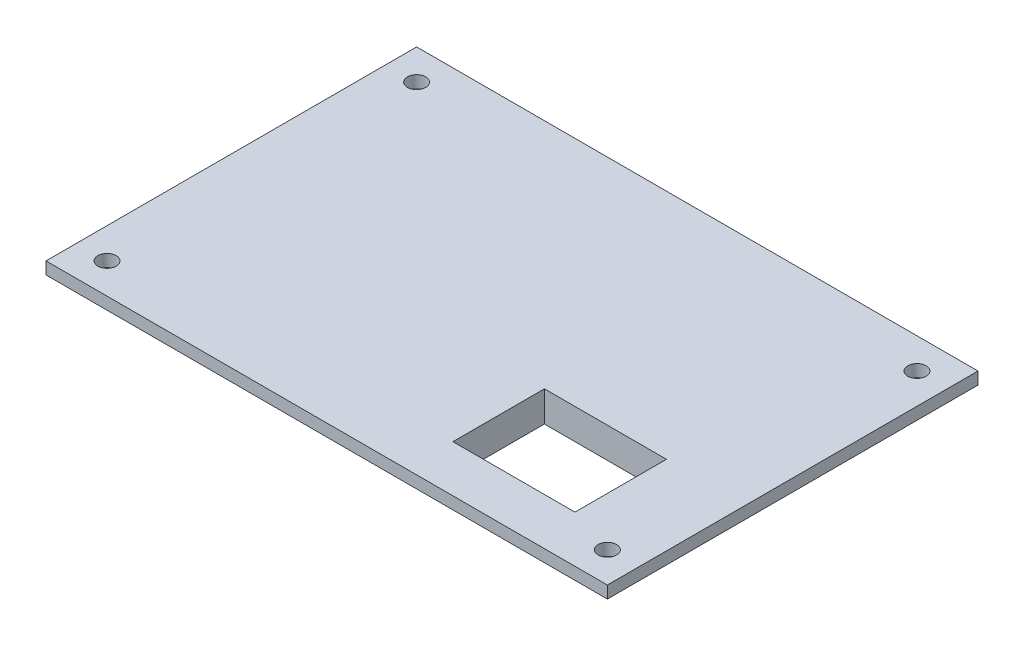
ISO-10303-21;
HEADER;
FILE_DESCRIPTION(('STEP AP214'),'2;1');
FILE_NAME('part.step','',(''),(''),'','','');
FILE_SCHEMA(('AUTOMOTIVE_DESIGN { 1 0 10303 214 1 1 1 1 }'));
ENDSEC;
DATA;
#1=APPLICATION_CONTEXT('core data for automotive mechanical design processes');
#2=APPLICATION_PROTOCOL_DEFINITION('international standard','automotive_design',2000,#1);
#3=PRODUCT_CONTEXT('',#1,'mechanical');
#4=PRODUCT('Part','Part','',(#3));
#5=PRODUCT_RELATED_PRODUCT_CATEGORY('part','',(#4));
#6=PRODUCT_DEFINITION_FORMATION('','',#4);
#7=PRODUCT_DEFINITION_CONTEXT('part definition',#1,'design');
#8=PRODUCT_DEFINITION('design','',#6,#7);
#9=PRODUCT_DEFINITION_SHAPE('','',#8);
#10=(LENGTH_UNIT() NAMED_UNIT(*) SI_UNIT(.MILLI.,.METRE.));
#11=(NAMED_UNIT(*) PLANE_ANGLE_UNIT() SI_UNIT($,.RADIAN.));
#12=(NAMED_UNIT(*) SI_UNIT($,.STERADIAN.) SOLID_ANGLE_UNIT());
#13=UNCERTAINTY_MEASURE_WITH_UNIT(LENGTH_MEASURE(1.E-05),#10,'distance_accuracy_value','');
#14=(GEOMETRIC_REPRESENTATION_CONTEXT(3) GLOBAL_UNCERTAINTY_ASSIGNED_CONTEXT((#13)) GLOBAL_UNIT_ASSIGNED_CONTEXT((#10,
#11,#12)) REPRESENTATION_CONTEXT('',''));
#15=CARTESIAN_POINT('',(0.,0.,0.));
#16=DIRECTION('',(0.,0.,1.));
#17=DIRECTION('',(1.,0.,0.));
#18=AXIS2_PLACEMENT_3D('',#15,#16,#17);
#19=CARTESIAN_POINT('',(0.,0.,0.));
#20=DIRECTION('',(0.,1.,0.));
#21=DIRECTION('',(0.,0.,1.));
#22=AXIS2_PLACEMENT_3D('',#19,#20,#21);
#23=PLANE('',#22);
#24=DIRECTION('',(-1.,0.,0.));
#25=VECTOR('',#24,1.);
#26=CARTESIAN_POINT('',(46.,0.,-30.37));
#27=LINE('',#26,#25);
#28=CARTESIAN_POINT('',(46.,0.,-30.37));
#29=VERTEX_POINT('',#28);
#30=CARTESIAN_POINT('',(-46.0000000000003,0.,-30.37));
#31=VERTEX_POINT('',#30);
#32=EDGE_CURVE('E218',#29,#31,#27,.T.);
#33=ORIENTED_EDGE('',*,*,#32,.F.);
#34=DIRECTION('',(0.,0.,-1.));
#35=VECTOR('',#34,1.);
#36=CARTESIAN_POINT('',(46.,0.,30.37));
#37=LINE('',#36,#35);
#38=CARTESIAN_POINT('',(46.,0.,30.37));
#39=VERTEX_POINT('',#38);
#40=EDGE_CURVE('E211',#39,#29,#37,.T.);
#41=ORIENTED_EDGE('',*,*,#40,.F.);
#42=DIRECTION('',(1.,0.,0.));
#43=VECTOR('',#42,1.);
#44=CARTESIAN_POINT('',(-46.0000000000003,0.,30.37));
#45=LINE('',#44,#43);
#46=CARTESIAN_POINT('',(-46.0000000000003,0.,30.37));
#47=VERTEX_POINT('',#46);
#48=EDGE_CURVE('E223',#47,#39,#45,.T.);
#49=ORIENTED_EDGE('',*,*,#48,.F.);
#50=DIRECTION('',(0.,0.,1.));
#51=VECTOR('',#50,1.);
#52=CARTESIAN_POINT('',(-46.0000000000003,0.,-30.37));
#53=LINE('',#52,#51);
#54=EDGE_CURVE('E221',#31,#47,#53,.T.);
#55=ORIENTED_EDGE('',*,*,#54,.F.);
#56=EDGE_LOOP('',(#33,#41,#49,#55));
#57=FACE_BOUND('',#56,.T.);
#58=CARTESIAN_POINT('',(-40.9999999999968,0.,-25.3700000000047));
#59=DIRECTION('',(0.,1.,0.));
#60=DIRECTION('',(0.,0.,1.));
#61=AXIS2_PLACEMENT_3D('',#58,#59,#60);
#62=CIRCLE('',#61,1.5);
#63=CARTESIAN_POINT('',(-40.9999999999968,0.,-23.8700000000047));
#64=VERTEX_POINT('',#63);
#65=EDGE_CURVE('E206',#64,#64,#62,.T.);
#66=ORIENTED_EDGE('',*,*,#65,.T.);
#67=EDGE_LOOP('',(#66));
#68=FACE_BOUND('',#67,.T.);
#69=CARTESIAN_POINT('',(41.0000000000002,0.,-25.3700000000047));
#70=DIRECTION('',(0.,1.,0.));
#71=DIRECTION('',(0.,0.,1.));
#72=AXIS2_PLACEMENT_3D('',#69,#70,#71);
#73=CIRCLE('',#72,1.5);
#74=CARTESIAN_POINT('',(41.0000000000002,0.,-23.8700000000047));
#75=VERTEX_POINT('',#74);
#76=EDGE_CURVE('E235',#75,#75,#73,.T.);
#77=ORIENTED_EDGE('',*,*,#76,.T.);
#78=EDGE_LOOP('',(#77));
#79=FACE_BOUND('',#78,.T.);
#80=CARTESIAN_POINT('',(41.0000000000002,0.,25.3700000000047));
#81=DIRECTION('',(0.,1.,0.));
#82=DIRECTION('',(0.,0.,1.));
#83=AXIS2_PLACEMENT_3D('',#80,#81,#82);
#84=CIRCLE('',#83,1.5);
#85=CARTESIAN_POINT('',(41.0000000000002,0.,26.8700000000047));
#86=VERTEX_POINT('',#85);
#87=EDGE_CURVE('E237',#86,#86,#84,.T.);
#88=ORIENTED_EDGE('',*,*,#87,.T.);
#89=EDGE_LOOP('',(#88));
#90=FACE_BOUND('',#89,.T.);
#91=CARTESIAN_POINT('',(-40.9999999999968,0.,25.3700000000047));
#92=DIRECTION('',(0.,1.,0.));
#93=DIRECTION('',(0.,0.,1.));
#94=AXIS2_PLACEMENT_3D('',#91,#92,#93);
#95=CIRCLE('',#94,1.5);
#96=CARTESIAN_POINT('',(-40.9999999999968,0.,26.8700000000047));
#97=VERTEX_POINT('',#96);
#98=EDGE_CURVE('E39',#97,#97,#95,.T.);
#99=ORIENTED_EDGE('',*,*,#98,.T.);
#100=EDGE_LOOP('',(#99));
#101=FACE_BOUND('',#100,.T.);
#102=DIRECTION('',(-1.,0.,0.));
#103=VECTOR('',#102,1.);
#104=CARTESIAN_POINT('',(35.0000000000095,0.,24.6849999999978));
#105=LINE('',#104,#103);
#106=CARTESIAN_POINT('',(35.0000000000095,0.,24.6849999999978));
#107=VERTEX_POINT('',#106);
#108=CARTESIAN_POINT('',(11.0000000000044,0.,24.6849999999978));
#109=VERTEX_POINT('',#108);
#110=EDGE_CURVE('E153',#107,#109,#105,.T.);
#111=ORIENTED_EDGE('',*,*,#110,.F.);
#112=DIRECTION('',(0.,0.,1.));
#113=VECTOR('',#112,1.);
#114=CARTESIAN_POINT('',(35.0000000000095,0.,5.68500000000463));
#115=LINE('',#114,#113);
#116=CARTESIAN_POINT('',(35.0000000000095,0.,5.68500000000463));
#117=VERTEX_POINT('',#116);
#118=EDGE_CURVE('E158',#117,#107,#115,.T.);
#119=ORIENTED_EDGE('',*,*,#118,.F.);
#120=DIRECTION('',(1.,0.,0.));
#121=VECTOR('',#120,1.);
#122=CARTESIAN_POINT('',(11.0000000000044,0.,5.68500000000463));
#123=LINE('',#122,#121);
#124=CARTESIAN_POINT('',(11.0000000000044,0.,5.68500000000463));
#125=VERTEX_POINT('',#124);
#126=EDGE_CURVE('E57',#125,#117,#123,.T.);
#127=ORIENTED_EDGE('',*,*,#126,.F.);
#128=DIRECTION('',(0.,0.,-1.));
#129=VECTOR('',#128,1.);
#130=CARTESIAN_POINT('',(11.0000000000044,0.,24.6849999999978));
#131=LINE('',#130,#129);
#132=EDGE_CURVE('E52',#109,#125,#131,.T.);
#133=ORIENTED_EDGE('',*,*,#132,.F.);
#134=EDGE_LOOP('',(#111,#119,#127,#133));
#135=FACE_BOUND('',#134,.T.);
#136=ADVANCED_FACE('F35',(#57,#68,#79,#90,#101,#135),#23,.F.);
#137=CARTESIAN_POINT('',(46.,2.,-30.37));
#138=DIRECTION('',(0.,0.,1.));
#139=DIRECTION('',(1.,0.,0.));
#140=AXIS2_PLACEMENT_3D('',#137,#138,#139);
#141=PLANE('',#140);
#142=ORIENTED_EDGE('',*,*,#32,.T.);
#143=DIRECTION('',(0.,-1.,0.));
#144=VECTOR('',#143,1.);
#145=CARTESIAN_POINT('',(-46.0000000000003,2.,-30.37));
#146=LINE('',#145,#144);
#147=CARTESIAN_POINT('',(-46.0000000000003,2.,-30.37));
#148=VERTEX_POINT('',#147);
#149=EDGE_CURVE('E11',#148,#31,#146,.T.);
#150=ORIENTED_EDGE('',*,*,#149,.F.);
#151=DIRECTION('',(-1.,0.,0.));
#152=VECTOR('',#151,1.);
#153=CARTESIAN_POINT('',(46.,2.,-30.37));
#154=LINE('',#153,#152);
#155=CARTESIAN_POINT('',(46.,2.,-30.37));
#156=VERTEX_POINT('',#155);
#157=EDGE_CURVE('E207',#156,#148,#154,.T.);
#158=ORIENTED_EDGE('',*,*,#157,.F.);
#159=DIRECTION('',(0.,-1.,0.));
#160=VECTOR('',#159,1.);
#161=CARTESIAN_POINT('',(46.,2.,-30.37));
#162=LINE('',#161,#160);
#163=EDGE_CURVE('E217',#156,#29,#162,.T.);
#164=ORIENTED_EDGE('',*,*,#163,.T.);
#165=EDGE_LOOP('',(#142,#150,#158,#164));
#166=FACE_BOUND('',#165,.T.);
#167=ADVANCED_FACE('F37',(#166),#141,.F.);
#168=CARTESIAN_POINT('',(-46.0000000000003,2.,-30.37));
#169=DIRECTION('',(1.,0.,0.));
#170=DIRECTION('',(0.,0.,-1.));
#171=AXIS2_PLACEMENT_3D('',#168,#169,#170);
#172=PLANE('',#171);
#173=ORIENTED_EDGE('',*,*,#54,.T.);
#174=DIRECTION('',(0.,-1.,0.));
#175=VECTOR('',#174,1.);
#176=CARTESIAN_POINT('',(-46.0000000000003,2.,30.37));
#177=LINE('',#176,#175);
#178=CARTESIAN_POINT('',(-46.0000000000003,2.,30.37));
#179=VERTEX_POINT('',#178);
#180=EDGE_CURVE('E44',#179,#47,#177,.T.);
#181=ORIENTED_EDGE('',*,*,#180,.F.);
#182=DIRECTION('',(0.,0.,1.));
#183=VECTOR('',#182,1.);
#184=CARTESIAN_POINT('',(-46.0000000000003,2.,-30.37));
#185=LINE('',#184,#183);
#186=EDGE_CURVE('E210',#148,#179,#185,.T.);
#187=ORIENTED_EDGE('',*,*,#186,.F.);
#188=ORIENTED_EDGE('',*,*,#149,.T.);
#189=EDGE_LOOP('',(#173,#181,#187,#188));
#190=FACE_BOUND('',#189,.T.);
#191=ADVANCED_FACE('F270',(#190),#172,.F.);
#192=CARTESIAN_POINT('',(-46.0000000000003,2.,30.37));
#193=DIRECTION('',(0.,0.,-1.));
#194=DIRECTION('',(-1.,0.,0.));
#195=AXIS2_PLACEMENT_3D('',#192,#193,#194);
#196=PLANE('',#195);
#197=ORIENTED_EDGE('',*,*,#48,.T.);
#198=DIRECTION('',(0.,-1.,0.));
#199=VECTOR('',#198,1.);
#200=CARTESIAN_POINT('',(46.,2.,30.37));
#201=LINE('',#200,#199);
#202=CARTESIAN_POINT('',(46.,2.,30.37));
#203=VERTEX_POINT('',#202);
#204=EDGE_CURVE('E228',#203,#39,#201,.T.);
#205=ORIENTED_EDGE('',*,*,#204,.F.);
#206=DIRECTION('',(1.,0.,0.));
#207=VECTOR('',#206,1.);
#208=CARTESIAN_POINT('',(-46.0000000000003,2.,30.37));
#209=LINE('',#208,#207);
#210=EDGE_CURVE('E213',#179,#203,#209,.T.);
#211=ORIENTED_EDGE('',*,*,#210,.F.);
#212=ORIENTED_EDGE('',*,*,#180,.T.);
#213=EDGE_LOOP('',(#197,#205,#211,#212));
#214=FACE_BOUND('',#213,.T.);
#215=ADVANCED_FACE('F280',(#214),#196,.F.);
#216=CARTESIAN_POINT('',(46.,2.,30.37));
#217=DIRECTION('',(-1.,0.,0.));
#218=DIRECTION('',(0.,0.,1.));
#219=AXIS2_PLACEMENT_3D('',#216,#217,#218);
#220=PLANE('',#219);
#221=ORIENTED_EDGE('',*,*,#40,.T.);
#222=ORIENTED_EDGE('',*,*,#163,.F.);
#223=DIRECTION('',(0.,0.,-1.));
#224=VECTOR('',#223,1.);
#225=CARTESIAN_POINT('',(46.,2.,30.37));
#226=LINE('',#225,#224);
#227=EDGE_CURVE('E215',#203,#156,#226,.T.);
#228=ORIENTED_EDGE('',*,*,#227,.F.);
#229=ORIENTED_EDGE('',*,*,#204,.T.);
#230=EDGE_LOOP('',(#221,#222,#228,#229));
#231=FACE_BOUND('',#230,.T.);
#232=ADVANCED_FACE('F277',(#231),#220,.F.);
#233=CARTESIAN_POINT('',(0.,2.,0.));
#234=DIRECTION('',(0.,1.,0.));
#235=DIRECTION('',(0.,0.,1.));
#236=AXIS2_PLACEMENT_3D('',#233,#234,#235);
#237=PLANE('',#236);
#238=DIRECTION('',(0.,0.,-1.));
#239=VECTOR('',#238,1.);
#240=CARTESIAN_POINT('',(33.0000000000095,2.,0.));
#241=LINE('',#240,#239);
#242=CARTESIAN_POINT('',(33.0000000000095,2.,22.6849999999978));
#243=VERTEX_POINT('',#242);
#244=CARTESIAN_POINT('',(33.0000000000095,2.,7.68500000000463));
#245=VERTEX_POINT('',#244);
#246=EDGE_CURVE('E181',#243,#245,#241,.T.);
#247=ORIENTED_EDGE('',*,*,#246,.F.);
#248=DIRECTION('',(1.,0.,0.));
#249=VECTOR('',#248,1.);
#250=CARTESIAN_POINT('',(0.,2.,22.6849999999978));
#251=LINE('',#250,#249);
#252=CARTESIAN_POINT('',(13.0000000000044,2.,22.6849999999978));
#253=VERTEX_POINT('',#252);
#254=EDGE_CURVE('E187',#253,#243,#251,.T.);
#255=ORIENTED_EDGE('',*,*,#254,.F.);
#256=DIRECTION('',(0.,0.,1.));
#257=VECTOR('',#256,1.);
#258=CARTESIAN_POINT('',(13.0000000000044,2.,0.));
#259=LINE('',#258,#257);
#260=CARTESIAN_POINT('',(13.0000000000044,2.,7.68500000000463));
#261=VERTEX_POINT('',#260);
#262=EDGE_CURVE('E131',#261,#253,#259,.T.);
#263=ORIENTED_EDGE('',*,*,#262,.F.);
#264=DIRECTION('',(-1.,0.,0.));
#265=VECTOR('',#264,1.);
#266=CARTESIAN_POINT('',(0.,2.,7.68500000000463));
#267=LINE('',#266,#265);
#268=EDGE_CURVE('E183',#245,#261,#267,.T.);
#269=ORIENTED_EDGE('',*,*,#268,.F.);
#270=EDGE_LOOP('',(#247,#255,#263,#269));
#271=FACE_BOUND('',#270,.T.);
#272=CARTESIAN_POINT('',(-40.9999999999968,2.,25.3700000000047));
#273=DIRECTION('',(0.,1.,0.));
#274=DIRECTION('',(0.,0.,1.));
#275=AXIS2_PLACEMENT_3D('',#272,#273,#274);
#276=CIRCLE('',#275,1.5);
#277=CARTESIAN_POINT('',(-40.9999999999968,2.,26.8700000000047));
#278=VERTEX_POINT('',#277);
#279=EDGE_CURVE('E190',#278,#278,#276,.T.);
#280=ORIENTED_EDGE('',*,*,#279,.F.);
#281=EDGE_LOOP('',(#280));
#282=FACE_BOUND('',#281,.T.);
#283=CARTESIAN_POINT('',(41.0000000000002,2.,25.3700000000047));
#284=DIRECTION('',(0.,1.,0.));
#285=DIRECTION('',(0.,0.,1.));
#286=AXIS2_PLACEMENT_3D('',#283,#284,#285);
#287=CIRCLE('',#286,1.5);
#288=CARTESIAN_POINT('',(41.0000000000002,2.,26.8700000000047));
#289=VERTEX_POINT('',#288);
#290=EDGE_CURVE('E199',#289,#289,#287,.T.);
#291=ORIENTED_EDGE('',*,*,#290,.F.);
#292=EDGE_LOOP('',(#291));
#293=FACE_BOUND('',#292,.T.);
#294=CARTESIAN_POINT('',(41.0000000000002,2.,-25.3700000000047));
#295=DIRECTION('',(0.,1.,0.));
#296=DIRECTION('',(0.,0.,1.));
#297=AXIS2_PLACEMENT_3D('',#294,#295,#296);
#298=CIRCLE('',#297,1.5);
#299=CARTESIAN_POINT('',(41.0000000000002,2.,-23.8700000000047));
#300=VERTEX_POINT('',#299);
#301=EDGE_CURVE('E195',#300,#300,#298,.T.);
#302=ORIENTED_EDGE('',*,*,#301,.F.);
#303=EDGE_LOOP('',(#302));
#304=FACE_BOUND('',#303,.T.);
#305=CARTESIAN_POINT('',(-40.9999999999968,2.,-25.3700000000047));
#306=DIRECTION('',(0.,1.,0.));
#307=DIRECTION('',(0.,0.,1.));
#308=AXIS2_PLACEMENT_3D('',#305,#306,#307);
#309=CIRCLE('',#308,1.5);
#310=CARTESIAN_POINT('',(-40.9999999999968,2.,-23.8700000000047));
#311=VERTEX_POINT('',#310);
#312=EDGE_CURVE('E198',#311,#311,#309,.T.);
#313=ORIENTED_EDGE('',*,*,#312,.F.);
#314=EDGE_LOOP('',(#313));
#315=FACE_BOUND('',#314,.T.);
#316=ORIENTED_EDGE('',*,*,#157,.T.);
#317=ORIENTED_EDGE('',*,*,#186,.T.);
#318=ORIENTED_EDGE('',*,*,#210,.T.);
#319=ORIENTED_EDGE('',*,*,#227,.T.);
#320=EDGE_LOOP('',(#316,#317,#318,#319));
#321=FACE_BOUND('',#320,.T.);
#322=ADVANCED_FACE('F276',(#271,#282,#293,#304,#315,#321),#237,.T.);
#323=CARTESIAN_POINT('',(-40.9999999999968,-8.,-25.3700000000047));
#324=DIRECTION('',(0.,1.,0.));
#325=DIRECTION('',(0.,0.,1.));
#326=AXIS2_PLACEMENT_3D('',#323,#324,#325);
#327=CYLINDRICAL_SURFACE('',#326,1.5);
#328=ORIENTED_EDGE('',*,*,#312,.T.);
#329=EDGE_LOOP('',(#328));
#330=FACE_BOUND('',#329,.T.);
#331=ORIENTED_EDGE('',*,*,#65,.F.);
#332=EDGE_LOOP('',(#331));
#333=FACE_BOUND('',#332,.T.);
#334=ADVANCED_FACE('F299',(#330,#333),#327,.F.);
#335=CARTESIAN_POINT('',(41.0000000000002,-8.,-25.3700000000047));
#336=DIRECTION('',(0.,1.,0.));
#337=DIRECTION('',(0.,0.,1.));
#338=AXIS2_PLACEMENT_3D('',#335,#336,#337);
#339=CYLINDRICAL_SURFACE('',#338,1.5);
#340=ORIENTED_EDGE('',*,*,#301,.T.);
#341=EDGE_LOOP('',(#340));
#342=FACE_BOUND('',#341,.T.);
#343=ORIENTED_EDGE('',*,*,#76,.F.);
#344=EDGE_LOOP('',(#343));
#345=FACE_BOUND('',#344,.T.);
#346=ADVANCED_FACE('F258',(#342,#345),#339,.F.);
#347=CARTESIAN_POINT('',(41.0000000000002,-8.,25.3700000000047));
#348=DIRECTION('',(0.,1.,0.));
#349=DIRECTION('',(0.,0.,1.));
#350=AXIS2_PLACEMENT_3D('',#347,#348,#349);
#351=CYLINDRICAL_SURFACE('',#350,1.5);
#352=ORIENTED_EDGE('',*,*,#290,.T.);
#353=EDGE_LOOP('',(#352));
#354=FACE_BOUND('',#353,.T.);
#355=ORIENTED_EDGE('',*,*,#87,.F.);
#356=EDGE_LOOP('',(#355));
#357=FACE_BOUND('',#356,.T.);
#358=ADVANCED_FACE('F248',(#354,#357),#351,.F.);
#359=CARTESIAN_POINT('',(-40.9999999999968,-8.,25.3700000000047));
#360=DIRECTION('',(0.,1.,0.));
#361=DIRECTION('',(0.,0.,1.));
#362=AXIS2_PLACEMENT_3D('',#359,#360,#361);
#363=CYLINDRICAL_SURFACE('',#362,1.5);
#364=ORIENTED_EDGE('',*,*,#279,.T.);
#365=EDGE_LOOP('',(#364));
#366=FACE_BOUND('',#365,.T.);
#367=ORIENTED_EDGE('',*,*,#98,.F.);
#368=EDGE_LOOP('',(#367));
#369=FACE_BOUND('',#368,.T.);
#370=ADVANCED_FACE('F245',(#366,#369),#363,.F.);
#371=CARTESIAN_POINT('',(33.0000000000095,-8.,0.));
#372=DIRECTION('',(1.,0.,0.));
#373=DIRECTION('',(0.,0.,-1.));
#374=AXIS2_PLACEMENT_3D('',#371,#372,#373);
#375=PLANE('',#374);
#376=DIRECTION('',(0.,1.,0.));
#377=VECTOR('',#376,1.);
#378=CARTESIAN_POINT('',(33.0000000000095,-8.,22.6849999999978));
#379=LINE('',#378,#377);
#380=CARTESIAN_POINT('',(33.0000000000095,-3.,22.6849999999978));
#381=VERTEX_POINT('',#380);
#382=EDGE_CURVE('E135',#381,#243,#379,.T.);
#383=ORIENTED_EDGE('',*,*,#382,.T.);
#384=ORIENTED_EDGE('',*,*,#246,.T.);
#385=DIRECTION('',(0.,1.,0.));
#386=VECTOR('',#385,1.);
#387=CARTESIAN_POINT('',(33.0000000000095,-8.,7.68500000000463));
#388=LINE('',#387,#386);
#389=CARTESIAN_POINT('',(33.0000000000095,-3.,7.68500000000463));
#390=VERTEX_POINT('',#389);
#391=EDGE_CURVE('E189',#390,#245,#388,.T.);
#392=ORIENTED_EDGE('',*,*,#391,.F.);
#393=DIRECTION('',(0.,0.,1.));
#394=VECTOR('',#393,1.);
#395=CARTESIAN_POINT('',(33.0000000000095,-3.,7.68500000000463));
#396=LINE('',#395,#394);
#397=EDGE_CURVE('E149',#390,#381,#396,.T.);
#398=ORIENTED_EDGE('',*,*,#397,.T.);
#399=EDGE_LOOP('',(#383,#384,#392,#398));
#400=FACE_BOUND('',#399,.T.);
#401=ADVANCED_FACE('F247',(#400),#375,.F.);
#402=CARTESIAN_POINT('',(0.,-8.,22.6849999999978));
#403=DIRECTION('',(0.,0.,1.));
#404=DIRECTION('',(1.,0.,0.));
#405=AXIS2_PLACEMENT_3D('',#402,#403,#404);
#406=PLANE('',#405);
#407=DIRECTION('',(0.,1.,0.));
#408=VECTOR('',#407,1.);
#409=CARTESIAN_POINT('',(13.0000000000044,-8.,22.6849999999978));
#410=LINE('',#409,#408);
#411=CARTESIAN_POINT('',(13.0000000000044,-3.,22.6849999999978));
#412=VERTEX_POINT('',#411);
#413=EDGE_CURVE('E124',#412,#253,#410,.T.);
#414=ORIENTED_EDGE('',*,*,#413,.T.);
#415=ORIENTED_EDGE('',*,*,#254,.T.);
#416=ORIENTED_EDGE('',*,*,#382,.F.);
#417=DIRECTION('',(-1.,0.,0.));
#418=VECTOR('',#417,1.);
#419=CARTESIAN_POINT('',(33.0000000000095,-3.,22.6849999999978));
#420=LINE('',#419,#418);
#421=EDGE_CURVE('E139',#381,#412,#420,.T.);
#422=ORIENTED_EDGE('',*,*,#421,.T.);
#423=EDGE_LOOP('',(#414,#415,#416,#422));
#424=FACE_BOUND('',#423,.T.);
#425=ADVANCED_FACE('F140',(#424),#406,.F.);
#426=CARTESIAN_POINT('',(13.0000000000044,-8.,0.));
#427=DIRECTION('',(-1.,0.,0.));
#428=DIRECTION('',(0.,0.,1.));
#429=AXIS2_PLACEMENT_3D('',#426,#427,#428);
#430=PLANE('',#429);
#431=DIRECTION('',(0.,1.,0.));
#432=VECTOR('',#431,1.);
#433=CARTESIAN_POINT('',(13.0000000000044,-8.,7.68500000000463));
#434=LINE('',#433,#432);
#435=CARTESIAN_POINT('',(13.0000000000044,-3.,7.68500000000463));
#436=VERTEX_POINT('',#435);
#437=EDGE_CURVE('E136',#436,#261,#434,.T.);
#438=ORIENTED_EDGE('',*,*,#437,.T.);
#439=ORIENTED_EDGE('',*,*,#262,.T.);
#440=ORIENTED_EDGE('',*,*,#413,.F.);
#441=DIRECTION('',(0.,0.,-1.));
#442=VECTOR('',#441,1.);
#443=CARTESIAN_POINT('',(13.0000000000044,-3.,22.6849999999978));
#444=LINE('',#443,#442);
#445=EDGE_CURVE('E128',#412,#436,#444,.T.);
#446=ORIENTED_EDGE('',*,*,#445,.T.);
#447=EDGE_LOOP('',(#438,#439,#440,#446));
#448=FACE_BOUND('',#447,.T.);
#449=ADVANCED_FACE('F126',(#448),#430,.F.);
#450=CARTESIAN_POINT('',(0.,-8.,7.68500000000463));
#451=DIRECTION('',(0.,0.,-1.));
#452=DIRECTION('',(-1.,0.,0.));
#453=AXIS2_PLACEMENT_3D('',#450,#451,#452);
#454=PLANE('',#453);
#455=ORIENTED_EDGE('',*,*,#391,.T.);
#456=ORIENTED_EDGE('',*,*,#268,.T.);
#457=ORIENTED_EDGE('',*,*,#437,.F.);
#458=DIRECTION('',(1.,0.,0.));
#459=VECTOR('',#458,1.);
#460=CARTESIAN_POINT('',(13.0000000000044,-3.,7.68500000000463));
#461=LINE('',#460,#459);
#462=EDGE_CURVE('E147',#436,#390,#461,.T.);
#463=ORIENTED_EDGE('',*,*,#462,.T.);
#464=EDGE_LOOP('',(#455,#456,#457,#463));
#465=FACE_BOUND('',#464,.T.);
#466=ADVANCED_FACE('F325',(#465),#454,.F.);
#467=CARTESIAN_POINT('',(0.,-3.,0.));
#468=DIRECTION('',(0.,-1.,0.));
#469=DIRECTION('',(0.,0.,-1.));
#470=AXIS2_PLACEMENT_3D('',#467,#468,#469);
#471=PLANE('',#470);
#472=DIRECTION('',(-1.,0.,0.));
#473=VECTOR('',#472,1.);
#474=CARTESIAN_POINT('',(35.0000000000095,-3.,24.6849999999978));
#475=LINE('',#474,#473);
#476=CARTESIAN_POINT('',(35.0000000000095,-3.,24.6849999999978));
#477=VERTEX_POINT('',#476);
#478=CARTESIAN_POINT('',(11.0000000000044,-3.,24.6849999999978));
#479=VERTEX_POINT('',#478);
#480=EDGE_CURVE('E154',#477,#479,#475,.T.);
#481=ORIENTED_EDGE('',*,*,#480,.T.);
#482=DIRECTION('',(0.,0.,-1.));
#483=VECTOR('',#482,1.);
#484=CARTESIAN_POINT('',(11.0000000000044,-3.,24.6849999999978));
#485=LINE('',#484,#483);
#486=CARTESIAN_POINT('',(11.0000000000044,-3.,5.68500000000463));
#487=VERTEX_POINT('',#486);
#488=EDGE_CURVE('E157',#479,#487,#485,.T.);
#489=ORIENTED_EDGE('',*,*,#488,.T.);
#490=DIRECTION('',(1.,0.,0.));
#491=VECTOR('',#490,1.);
#492=CARTESIAN_POINT('',(11.0000000000044,-3.,5.68500000000463));
#493=LINE('',#492,#491);
#494=CARTESIAN_POINT('',(35.0000000000095,-3.,5.68500000000463));
#495=VERTEX_POINT('',#494);
#496=EDGE_CURVE('E160',#487,#495,#493,.T.);
#497=ORIENTED_EDGE('',*,*,#496,.T.);
#498=DIRECTION('',(0.,0.,1.));
#499=VECTOR('',#498,1.);
#500=CARTESIAN_POINT('',(35.0000000000095,-3.,5.68500000000463));
#501=LINE('',#500,#499);
#502=EDGE_CURVE('E162',#495,#477,#501,.T.);
#503=ORIENTED_EDGE('',*,*,#502,.T.);
#504=EDGE_LOOP('',(#481,#489,#497,#503));
#505=FACE_BOUND('',#504,.T.);
#506=ORIENTED_EDGE('',*,*,#445,.F.);
#507=ORIENTED_EDGE('',*,*,#421,.F.);
#508=ORIENTED_EDGE('',*,*,#397,.F.);
#509=ORIENTED_EDGE('',*,*,#462,.F.);
#510=EDGE_LOOP('',(#506,#507,#508,#509));
#511=FACE_BOUND('',#510,.T.);
#512=ADVANCED_FACE('F145',(#505,#511),#471,.T.);
#513=CARTESIAN_POINT('',(35.0000000000095,-3.,24.6849999999978));
#514=DIRECTION('',(0.,0.,-1.));
#515=DIRECTION('',(-1.,0.,0.));
#516=AXIS2_PLACEMENT_3D('',#513,#514,#515);
#517=PLANE('',#516);
#518=ORIENTED_EDGE('',*,*,#110,.T.);
#519=DIRECTION('',(0.,1.,0.));
#520=VECTOR('',#519,1.);
#521=CARTESIAN_POINT('',(11.0000000000044,-3.,24.6849999999978));
#522=LINE('',#521,#520);
#523=EDGE_CURVE('E179',#479,#109,#522,.T.);
#524=ORIENTED_EDGE('',*,*,#523,.F.);
#525=ORIENTED_EDGE('',*,*,#480,.F.);
#526=DIRECTION('',(0.,1.,0.));
#527=VECTOR('',#526,1.);
#528=CARTESIAN_POINT('',(35.0000000000095,-3.,24.6849999999978));
#529=LINE('',#528,#527);
#530=EDGE_CURVE('E164',#477,#107,#529,.T.);
#531=ORIENTED_EDGE('',*,*,#530,.T.);
#532=EDGE_LOOP('',(#518,#524,#525,#531));
#533=FACE_BOUND('',#532,.T.);
#534=ADVANCED_FACE('F333',(#533),#517,.F.);
#535=CARTESIAN_POINT('',(11.0000000000044,-3.,24.6849999999978));
#536=DIRECTION('',(1.,0.,0.));
#537=DIRECTION('',(0.,0.,-1.));
#538=AXIS2_PLACEMENT_3D('',#535,#536,#537);
#539=PLANE('',#538);
#540=ORIENTED_EDGE('',*,*,#132,.T.);
#541=DIRECTION('',(0.,1.,0.));
#542=VECTOR('',#541,1.);
#543=CARTESIAN_POINT('',(11.0000000000044,-3.,5.68500000000463));
#544=LINE('',#543,#542);
#545=EDGE_CURVE('E176',#487,#125,#544,.T.);
#546=ORIENTED_EDGE('',*,*,#545,.F.);
#547=ORIENTED_EDGE('',*,*,#488,.F.);
#548=ORIENTED_EDGE('',*,*,#523,.T.);
#549=EDGE_LOOP('',(#540,#546,#547,#548));
#550=FACE_BOUND('',#549,.T.);
#551=ADVANCED_FACE('F336',(#550),#539,.F.);
#552=CARTESIAN_POINT('',(11.0000000000044,-3.,5.68500000000463));
#553=DIRECTION('',(0.,0.,1.));
#554=DIRECTION('',(1.,0.,0.));
#555=AXIS2_PLACEMENT_3D('',#552,#553,#554);
#556=PLANE('',#555);
#557=ORIENTED_EDGE('',*,*,#126,.T.);
#558=DIRECTION('',(0.,1.,0.));
#559=VECTOR('',#558,1.);
#560=CARTESIAN_POINT('',(35.0000000000095,-3.,5.68500000000463));
#561=LINE('',#560,#559);
#562=EDGE_CURVE('E173',#495,#117,#561,.T.);
#563=ORIENTED_EDGE('',*,*,#562,.F.);
#564=ORIENTED_EDGE('',*,*,#496,.F.);
#565=ORIENTED_EDGE('',*,*,#545,.T.);
#566=EDGE_LOOP('',(#557,#563,#564,#565));
#567=FACE_BOUND('',#566,.T.);
#568=ADVANCED_FACE('F340',(#567),#556,.F.);
#569=CARTESIAN_POINT('',(35.0000000000095,-3.,5.68500000000463));
#570=DIRECTION('',(-1.,0.,0.));
#571=DIRECTION('',(0.,0.,1.));
#572=AXIS2_PLACEMENT_3D('',#569,#570,#571);
#573=PLANE('',#572);
#574=ORIENTED_EDGE('',*,*,#118,.T.);
#575=ORIENTED_EDGE('',*,*,#530,.F.);
#576=ORIENTED_EDGE('',*,*,#502,.F.);
#577=ORIENTED_EDGE('',*,*,#562,.T.);
#578=EDGE_LOOP('',(#574,#575,#576,#577));
#579=FACE_BOUND('',#578,.T.);
#580=ADVANCED_FACE('F344',(#579),#573,.F.);
#581=CLOSED_SHELL('',(#136,#167,#191,#215,#232,#322,#334,#346,#358,#370,#401,#425,#449,#466,
#512,#534,#551,#568,#580));
#582=MANIFOLD_SOLID_BREP('B2',#581);
#583=ADVANCED_BREP_SHAPE_REPRESENTATION('',(#18,#582),#14);
#584=SHAPE_DEFINITION_REPRESENTATION(#9,#583);
ENDSEC;
END-ISO-10303-21;
